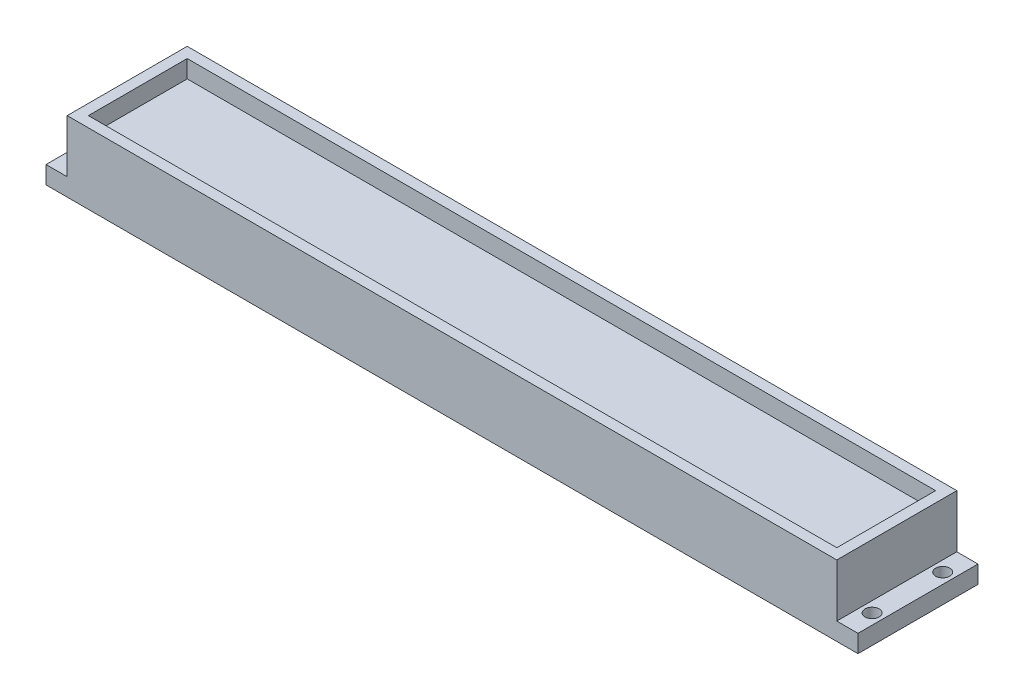
ISO-10303-21;
HEADER;
FILE_DESCRIPTION(('STEP AP214'),'2;1');
FILE_NAME('part.step','',(''),(''),'','','');
FILE_SCHEMA(('AUTOMOTIVE_DESIGN { 1 0 10303 214 1 1 1 1 }'));
ENDSEC;
DATA;
#1=APPLICATION_CONTEXT('core data for automotive mechanical design processes');
#2=APPLICATION_PROTOCOL_DEFINITION('international standard','automotive_design',2000,#1);
#3=PRODUCT_CONTEXT('',#1,'mechanical');
#4=PRODUCT('Part','Part','',(#3));
#5=PRODUCT_RELATED_PRODUCT_CATEGORY('part','',(#4));
#6=PRODUCT_DEFINITION_FORMATION('','',#4);
#7=PRODUCT_DEFINITION_CONTEXT('part definition',#1,'design');
#8=PRODUCT_DEFINITION('design','',#6,#7);
#9=PRODUCT_DEFINITION_SHAPE('','',#8);
#10=(LENGTH_UNIT() NAMED_UNIT(*) SI_UNIT(.MILLI.,.METRE.));
#11=(NAMED_UNIT(*) PLANE_ANGLE_UNIT() SI_UNIT($,.RADIAN.));
#12=(NAMED_UNIT(*) SI_UNIT($,.STERADIAN.) SOLID_ANGLE_UNIT());
#13=UNCERTAINTY_MEASURE_WITH_UNIT(LENGTH_MEASURE(1.E-05),#10,'distance_accuracy_value','');
#14=(GEOMETRIC_REPRESENTATION_CONTEXT(3) GLOBAL_UNCERTAINTY_ASSIGNED_CONTEXT((#13)) GLOBAL_UNIT_ASSIGNED_CONTEXT((#10,
#11,#12)) REPRESENTATION_CONTEXT('',''));
#15=CARTESIAN_POINT('',(0.,0.,0.));
#16=DIRECTION('',(0.,0.,1.));
#17=DIRECTION('',(1.,0.,0.));
#18=AXIS2_PLACEMENT_3D('',#15,#16,#17);
#19=CARTESIAN_POINT('',(0.,0.,34.));
#20=DIRECTION('',(1.,0.,0.));
#21=DIRECTION('',(0.,0.,-1.));
#22=AXIS2_PLACEMENT_3D('',#19,#20,#21);
#23=PLANE('',#22);
#24=DIRECTION('',(0.,-1.,0.));
#25=VECTOR('',#24,1.);
#26=CARTESIAN_POINT('',(0.,0.,0.));
#27=LINE('',#26,#25);
#28=CARTESIAN_POINT('',(0.,5.,0.));
#29=VERTEX_POINT('',#28);
#30=CARTESIAN_POINT('',(0.,0.,0.));
#31=VERTEX_POINT('',#30);
#32=EDGE_CURVE('E173',#29,#31,#27,.T.);
#33=ORIENTED_EDGE('',*,*,#32,.T.);
#34=DIRECTION('',(0.,0.,-1.));
#35=VECTOR('',#34,1.);
#36=CARTESIAN_POINT('',(0.,0.,34.));
#37=LINE('',#36,#35);
#38=CARTESIAN_POINT('',(0.,0.,34.));
#39=VERTEX_POINT('',#38);
#40=EDGE_CURVE('E11',#39,#31,#37,.T.);
#41=ORIENTED_EDGE('',*,*,#40,.F.);
#42=DIRECTION('',(0.,-1.,0.));
#43=VECTOR('',#42,1.);
#44=CARTESIAN_POINT('',(0.,0.,34.));
#45=LINE('',#44,#43);
#46=CARTESIAN_POINT('',(0.,5.,34.));
#47=VERTEX_POINT('',#46);
#48=EDGE_CURVE('E185',#47,#39,#45,.T.);
#49=ORIENTED_EDGE('',*,*,#48,.F.);
#50=DIRECTION('',(0.,0.,-1.));
#51=VECTOR('',#50,1.);
#52=CARTESIAN_POINT('',(0.,5.,34.));
#53=LINE('',#52,#51);
#54=EDGE_CURVE('E186',#47,#29,#53,.T.);
#55=ORIENTED_EDGE('',*,*,#54,.T.);
#56=EDGE_LOOP('',(#33,#41,#49,#55));
#57=FACE_BOUND('',#56,.T.);
#58=ADVANCED_FACE('F34',(#57),#23,.F.);
#59=CARTESIAN_POINT('',(0.,0.,34.));
#60=DIRECTION('',(0.,1.,0.));
#61=DIRECTION('',(0.,0.,1.));
#62=AXIS2_PLACEMENT_3D('',#59,#60,#61);
#63=PLANE('',#62);
#64=CARTESIAN_POINT('',(227.,0.,7.));
#65=DIRECTION('',(0.,1.,0.));
#66=DIRECTION('',(0.,0.,1.));
#67=AXIS2_PLACEMENT_3D('',#64,#65,#66);
#68=CIRCLE('',#67,2.);
#69=CARTESIAN_POINT('',(227.,0.,9.));
#70=VERTEX_POINT('',#69);
#71=EDGE_CURVE('E400',#70,#70,#68,.F.);
#72=ORIENTED_EDGE('',*,*,#71,.F.);
#73=EDGE_LOOP('',(#72));
#74=FACE_BOUND('',#73,.T.);
#75=CARTESIAN_POINT('',(227.,0.,27.));
#76=DIRECTION('',(0.,1.,0.));
#77=DIRECTION('',(0.,0.,1.));
#78=AXIS2_PLACEMENT_3D('',#75,#76,#77);
#79=CIRCLE('',#78,2.);
#80=CARTESIAN_POINT('',(227.,0.,29.));
#81=VERTEX_POINT('',#80);
#82=EDGE_CURVE('E404',#81,#81,#79,.F.);
#83=ORIENTED_EDGE('',*,*,#82,.F.);
#84=EDGE_LOOP('',(#83));
#85=FACE_BOUND('',#84,.T.);
#86=CARTESIAN_POINT('',(3.,0.,27.));
#87=DIRECTION('',(0.,1.,0.));
#88=DIRECTION('',(0.,0.,1.));
#89=AXIS2_PLACEMENT_3D('',#86,#87,#88);
#90=CIRCLE('',#89,2.);
#91=CARTESIAN_POINT('',(3.,0.,29.));
#92=VERTEX_POINT('',#91);
#93=EDGE_CURVE('E413',#92,#92,#90,.F.);
#94=ORIENTED_EDGE('',*,*,#93,.F.);
#95=EDGE_LOOP('',(#94));
#96=FACE_BOUND('',#95,.T.);
#97=CARTESIAN_POINT('',(3.,0.,7.));
#98=DIRECTION('',(0.,1.,0.));
#99=DIRECTION('',(0.,0.,1.));
#100=AXIS2_PLACEMENT_3D('',#97,#98,#99);
#101=CIRCLE('',#100,2.);
#102=CARTESIAN_POINT('',(3.,0.,9.));
#103=VERTEX_POINT('',#102);
#104=EDGE_CURVE('E134',#103,#103,#101,.F.);
#105=ORIENTED_EDGE('',*,*,#104,.F.);
#106=EDGE_LOOP('',(#105));
#107=FACE_BOUND('',#106,.T.);
#108=DIRECTION('',(1.,0.,0.));
#109=VECTOR('',#108,1.);
#110=CARTESIAN_POINT('',(0.,0.,0.));
#111=LINE('',#110,#109);
#112=CARTESIAN_POINT('',(230.,0.,0.));
#113=VERTEX_POINT('',#112);
#114=EDGE_CURVE('E167',#31,#113,#111,.T.);
#115=ORIENTED_EDGE('',*,*,#114,.T.);
#116=DIRECTION('',(0.,0.,-1.));
#117=VECTOR('',#116,1.);
#118=CARTESIAN_POINT('',(230.,0.,34.));
#119=LINE('',#118,#117);
#120=CARTESIAN_POINT('',(230.,0.,34.));
#121=VERTEX_POINT('',#120);
#122=EDGE_CURVE('E41',#121,#113,#119,.T.);
#123=ORIENTED_EDGE('',*,*,#122,.F.);
#124=DIRECTION('',(1.,0.,0.));
#125=VECTOR('',#124,1.);
#126=CARTESIAN_POINT('',(0.,0.,34.));
#127=LINE('',#126,#125);
#128=EDGE_CURVE('E219',#39,#121,#127,.T.);
#129=ORIENTED_EDGE('',*,*,#128,.F.);
#130=ORIENTED_EDGE('',*,*,#40,.T.);
#131=EDGE_LOOP('',(#115,#123,#129,#130));
#132=FACE_BOUND('',#131,.T.);
#133=ADVANCED_FACE('F242',(#74,#85,#96,#107,#132),#63,.F.);
#134=CARTESIAN_POINT('',(230.,0.,34.));
#135=DIRECTION('',(-1.,0.,0.));
#136=DIRECTION('',(0.,0.,1.));
#137=AXIS2_PLACEMENT_3D('',#134,#135,#136);
#138=PLANE('',#137);
#139=DIRECTION('',(0.,1.,0.));
#140=VECTOR('',#139,1.);
#141=CARTESIAN_POINT('',(230.,0.,0.));
#142=LINE('',#141,#140);
#143=CARTESIAN_POINT('',(230.,5.,0.));
#144=VERTEX_POINT('',#143);
#145=EDGE_CURVE('E160',#113,#144,#142,.T.);
#146=ORIENTED_EDGE('',*,*,#145,.T.);
#147=DIRECTION('',(0.,0.,-1.));
#148=VECTOR('',#147,1.);
#149=CARTESIAN_POINT('',(230.,5.,34.));
#150=LINE('',#149,#148);
#151=CARTESIAN_POINT('',(230.,5.,34.));
#152=VERTEX_POINT('',#151);
#153=EDGE_CURVE('E151',#152,#144,#150,.T.);
#154=ORIENTED_EDGE('',*,*,#153,.F.);
#155=DIRECTION('',(0.,1.,0.));
#156=VECTOR('',#155,1.);
#157=CARTESIAN_POINT('',(230.,0.,34.));
#158=LINE('',#157,#156);
#159=EDGE_CURVE('E161',#121,#152,#158,.T.);
#160=ORIENTED_EDGE('',*,*,#159,.F.);
#161=ORIENTED_EDGE('',*,*,#122,.T.);
#162=EDGE_LOOP('',(#146,#154,#160,#161));
#163=FACE_BOUND('',#162,.T.);
#164=ADVANCED_FACE('F158',(#163),#138,.F.);
#165=CARTESIAN_POINT('',(230.,5.,34.));
#166=DIRECTION('',(0.,-1.,0.));
#167=DIRECTION('',(1.,0.,0.));
#168=AXIS2_PLACEMENT_3D('',#165,#166,#167);
#169=PLANE('',#168);
#170=CARTESIAN_POINT('',(227.,5.,7.));
#171=DIRECTION('',(0.,1.,0.));
#172=DIRECTION('',(0.,0.,-1.));
#173=AXIS2_PLACEMENT_3D('',#170,#171,#172);
#174=CIRCLE('',#173,2.);
#175=CARTESIAN_POINT('',(227.,5.,5.));
#176=VERTEX_POINT('',#175);
#177=EDGE_CURVE('E398',#176,#176,#174,.T.);
#178=ORIENTED_EDGE('',*,*,#177,.F.);
#179=EDGE_LOOP('',(#178));
#180=FACE_BOUND('',#179,.T.);
#181=CARTESIAN_POINT('',(227.,5.,27.));
#182=DIRECTION('',(0.,1.,0.));
#183=DIRECTION('',(0.,0.,-1.));
#184=AXIS2_PLACEMENT_3D('',#181,#182,#183);
#185=CIRCLE('',#184,2.);
#186=CARTESIAN_POINT('',(227.,5.,25.));
#187=VERTEX_POINT('',#186);
#188=EDGE_CURVE('E401',#187,#187,#185,.T.);
#189=ORIENTED_EDGE('',*,*,#188,.F.);
#190=EDGE_LOOP('',(#189));
#191=FACE_BOUND('',#190,.T.);
#192=DIRECTION('',(-1.,0.,0.));
#193=VECTOR('',#192,1.);
#194=CARTESIAN_POINT('',(230.,5.,0.));
#195=LINE('',#194,#193);
#196=CARTESIAN_POINT('',(224.,5.,0.));
#197=VERTEX_POINT('',#196);
#198=EDGE_CURVE('E169',#144,#197,#195,.T.);
#199=ORIENTED_EDGE('',*,*,#198,.T.);
#200=DIRECTION('',(0.,0.,-1.));
#201=VECTOR('',#200,1.);
#202=CARTESIAN_POINT('',(224.,5.,34.));
#203=LINE('',#202,#201);
#204=CARTESIAN_POINT('',(224.,5.,34.));
#205=VERTEX_POINT('',#204);
#206=EDGE_CURVE('E148',#205,#197,#203,.T.);
#207=ORIENTED_EDGE('',*,*,#206,.F.);
#208=DIRECTION('',(-1.,0.,0.));
#209=VECTOR('',#208,1.);
#210=CARTESIAN_POINT('',(230.,5.,34.));
#211=LINE('',#210,#209);
#212=EDGE_CURVE('E222',#152,#205,#211,.T.);
#213=ORIENTED_EDGE('',*,*,#212,.F.);
#214=ORIENTED_EDGE('',*,*,#153,.T.);
#215=EDGE_LOOP('',(#199,#207,#213,#214));
#216=FACE_BOUND('',#215,.T.);
#217=ADVANCED_FACE('F246',(#180,#191,#216),#169,.F.);
#218=CARTESIAN_POINT('',(224.,20.,34.));
#219=DIRECTION('',(-1.,0.,0.));
#220=DIRECTION('',(0.,0.,1.));
#221=AXIS2_PLACEMENT_3D('',#218,#219,#220);
#222=PLANE('',#221);
#223=DIRECTION('',(0.,1.,0.));
#224=VECTOR('',#223,1.);
#225=CARTESIAN_POINT('',(224.,20.,0.));
#226=LINE('',#225,#224);
#227=CARTESIAN_POINT('',(224.,20.,0.));
#228=VERTEX_POINT('',#227);
#229=EDGE_CURVE('E171',#197,#228,#226,.T.);
#230=ORIENTED_EDGE('',*,*,#229,.T.);
#231=DIRECTION('',(0.,0.,-1.));
#232=VECTOR('',#231,1.);
#233=CARTESIAN_POINT('',(224.,20.,34.));
#234=LINE('',#233,#232);
#235=CARTESIAN_POINT('',(224.,20.,34.));
#236=VERTEX_POINT('',#235);
#237=EDGE_CURVE('E140',#236,#228,#234,.T.);
#238=ORIENTED_EDGE('',*,*,#237,.F.);
#239=DIRECTION('',(0.,1.,0.));
#240=VECTOR('',#239,1.);
#241=CARTESIAN_POINT('',(224.,20.,34.));
#242=LINE('',#241,#240);
#243=EDGE_CURVE('E224',#205,#236,#242,.T.);
#244=ORIENTED_EDGE('',*,*,#243,.F.);
#245=ORIENTED_EDGE('',*,*,#206,.T.);
#246=EDGE_LOOP('',(#230,#238,#244,#245));
#247=FACE_BOUND('',#246,.T.);
#248=ADVANCED_FACE('F250',(#247),#222,.F.);
#249=CARTESIAN_POINT('',(221.,20.,34.));
#250=DIRECTION('',(1.,0.,0.));
#251=DIRECTION('',(0.,0.,-1.));
#252=AXIS2_PLACEMENT_3D('',#249,#250,#251);
#253=PLANE('',#252);
#254=DIRECTION('',(0.,0.,-1.));
#255=VECTOR('',#254,1.);
#256=CARTESIAN_POINT('',(221.,15.,34.));
#257=LINE('',#256,#255);
#258=CARTESIAN_POINT('',(221.,14.9999999999864,31.));
#259=VERTEX_POINT('',#258);
#260=CARTESIAN_POINT('',(221.,15.,3.));
#261=VERTEX_POINT('',#260);
#262=EDGE_CURVE('E56',#259,#261,#257,.T.);
#263=ORIENTED_EDGE('',*,*,#262,.F.);
#264=DIRECTION('',(0.,1.,0.));
#265=VECTOR('',#264,1.);
#266=CARTESIAN_POINT('',(221.,-500000.,31.));
#267=LINE('',#266,#265);
#268=CARTESIAN_POINT('',(221.,20.,31.));
#269=VERTEX_POINT('',#268);
#270=EDGE_CURVE('E123',#259,#269,#267,.T.);
#271=ORIENTED_EDGE('',*,*,#270,.T.);
#272=DIRECTION('',(0.,0.,-1.));
#273=VECTOR('',#272,1.);
#274=CARTESIAN_POINT('',(221.,20.,34.));
#275=LINE('',#274,#273);
#276=CARTESIAN_POINT('',(221.,20.,3.));
#277=VERTEX_POINT('',#276);
#278=EDGE_CURVE('E48',#269,#277,#275,.T.);
#279=ORIENTED_EDGE('',*,*,#278,.T.);
#280=DIRECTION('',(0.,1.,0.));
#281=VECTOR('',#280,1.);
#282=CARTESIAN_POINT('',(221.,-500000.,3.));
#283=LINE('',#282,#281);
#284=EDGE_CURVE('E137',#261,#277,#283,.T.);
#285=ORIENTED_EDGE('',*,*,#284,.F.);
#286=EDGE_LOOP('',(#263,#271,#279,#285));
#287=FACE_BOUND('',#286,.T.);
#288=ADVANCED_FACE('F136',(#287),#253,.F.);
#289=CARTESIAN_POINT('',(221.,15.,34.));
#290=DIRECTION('',(0.,-1.,0.));
#291=DIRECTION('',(0.,0.,-1.));
#292=AXIS2_PLACEMENT_3D('',#289,#290,#291);
#293=PLANE('',#292);
#294=DIRECTION('',(0.,0.,-1.));
#295=VECTOR('',#294,1.);
#296=CARTESIAN_POINT('',(9.,15.,34.));
#297=LINE('',#296,#295);
#298=CARTESIAN_POINT('',(9.,14.9999999999864,31.));
#299=VERTEX_POINT('',#298);
#300=CARTESIAN_POINT('',(9.,15.,3.));
#301=VERTEX_POINT('',#300);
#302=EDGE_CURVE('E133',#299,#301,#297,.T.);
#303=ORIENTED_EDGE('',*,*,#302,.F.);
#304=DIRECTION('',(-1.,0.,0.));
#305=VECTOR('',#304,1.);
#306=CARTESIAN_POINT('',(9.,14.9999999999864,31.));
#307=LINE('',#306,#305);
#308=EDGE_CURVE('E125',#259,#299,#307,.T.);
#309=ORIENTED_EDGE('',*,*,#308,.F.);
#310=ORIENTED_EDGE('',*,*,#262,.T.);
#311=DIRECTION('',(1.,0.,0.));
#312=VECTOR('',#311,1.);
#313=CARTESIAN_POINT('',(221.,14.9999999999864,3.));
#314=LINE('',#313,#312);
#315=EDGE_CURVE('E208',#301,#261,#314,.T.);
#316=ORIENTED_EDGE('',*,*,#315,.F.);
#317=EDGE_LOOP('',(#303,#309,#310,#316));
#318=FACE_BOUND('',#317,.T.);
#319=ADVANCED_FACE('F132',(#318),#293,.F.);
#320=CARTESIAN_POINT('',(9.,20.,34.));
#321=DIRECTION('',(-1.,0.,0.));
#322=DIRECTION('',(0.,0.,1.));
#323=AXIS2_PLACEMENT_3D('',#320,#321,#322);
#324=PLANE('',#323);
#325=DIRECTION('',(0.,0.,-1.));
#326=VECTOR('',#325,1.);
#327=CARTESIAN_POINT('',(9.,20.,34.));
#328=LINE('',#327,#326);
#329=CARTESIAN_POINT('',(9.,20.,31.));
#330=VERTEX_POINT('',#329);
#331=CARTESIAN_POINT('',(9.,20.,3.));
#332=VERTEX_POINT('',#331);
#333=EDGE_CURVE('E142',#330,#332,#328,.T.);
#334=ORIENTED_EDGE('',*,*,#333,.F.);
#335=DIRECTION('',(0.,1.,0.));
#336=VECTOR('',#335,1.);
#337=CARTESIAN_POINT('',(9.,-500000.,31.));
#338=LINE('',#337,#336);
#339=EDGE_CURVE('E129',#299,#330,#338,.T.);
#340=ORIENTED_EDGE('',*,*,#339,.F.);
#341=ORIENTED_EDGE('',*,*,#302,.T.);
#342=DIRECTION('',(0.,1.,0.));
#343=VECTOR('',#342,1.);
#344=CARTESIAN_POINT('',(9.00000000000001,-500000.,3.));
#345=LINE('',#344,#343);
#346=EDGE_CURVE('E205',#301,#332,#345,.T.);
#347=ORIENTED_EDGE('',*,*,#346,.T.);
#348=EDGE_LOOP('',(#334,#340,#341,#347));
#349=FACE_BOUND('',#348,.T.);
#350=ADVANCED_FACE('F206',(#349),#324,.F.);
#351=CARTESIAN_POINT('',(6.,20.,34.));
#352=DIRECTION('',(0.,-1.,0.));
#353=DIRECTION('',(0.,0.,-1.));
#354=AXIS2_PLACEMENT_3D('',#351,#352,#353);
#355=PLANE('',#354);
#356=ORIENTED_EDGE('',*,*,#278,.F.);
#357=DIRECTION('',(-1.,0.,0.));
#358=VECTOR('',#357,1.);
#359=CARTESIAN_POINT('',(9.,20.,31.));
#360=LINE('',#359,#358);
#361=EDGE_CURVE('E128',#269,#330,#360,.T.);
#362=ORIENTED_EDGE('',*,*,#361,.T.);
#363=ORIENTED_EDGE('',*,*,#333,.T.);
#364=DIRECTION('',(1.,0.,0.));
#365=VECTOR('',#364,1.);
#366=CARTESIAN_POINT('',(221.,20.,3.));
#367=LINE('',#366,#365);
#368=EDGE_CURVE('E202',#332,#277,#367,.T.);
#369=ORIENTED_EDGE('',*,*,#368,.T.);
#370=EDGE_LOOP('',(#356,#362,#363,#369));
#371=FACE_BOUND('',#370,.T.);
#372=DIRECTION('',(-1.,0.,0.));
#373=VECTOR('',#372,1.);
#374=CARTESIAN_POINT('',(6.,20.,0.));
#375=LINE('',#374,#373);
#376=CARTESIAN_POINT('',(6.,20.,0.));
#377=VERTEX_POINT('',#376);
#378=EDGE_CURVE('E179',#228,#377,#375,.T.);
#379=ORIENTED_EDGE('',*,*,#378,.T.);
#380=DIRECTION('',(0.,0.,-1.));
#381=VECTOR('',#380,1.);
#382=CARTESIAN_POINT('',(6.,20.,34.));
#383=LINE('',#382,#381);
#384=CARTESIAN_POINT('',(6.,20.,34.));
#385=VERTEX_POINT('',#384);
#386=EDGE_CURVE('E193',#385,#377,#383,.T.);
#387=ORIENTED_EDGE('',*,*,#386,.F.);
#388=DIRECTION('',(-1.,0.,0.));
#389=VECTOR('',#388,1.);
#390=CARTESIAN_POINT('',(224.,20.,34.));
#391=LINE('',#390,#389);
#392=EDGE_CURVE('E226',#236,#385,#391,.T.);
#393=ORIENTED_EDGE('',*,*,#392,.F.);
#394=ORIENTED_EDGE('',*,*,#237,.T.);
#395=EDGE_LOOP('',(#379,#387,#393,#394));
#396=FACE_BOUND('',#395,.T.);
#397=ADVANCED_FACE('F199',(#371,#396),#355,.F.);
#398=CARTESIAN_POINT('',(6.,5.,34.));
#399=DIRECTION('',(1.,0.,0.));
#400=DIRECTION('',(0.,0.,-1.));
#401=AXIS2_PLACEMENT_3D('',#398,#399,#400);
#402=PLANE('',#401);
#403=DIRECTION('',(0.,-1.,0.));
#404=VECTOR('',#403,1.);
#405=CARTESIAN_POINT('',(6.,5.,0.));
#406=LINE('',#405,#404);
#407=CARTESIAN_POINT('',(6.,5.,0.));
#408=VERTEX_POINT('',#407);
#409=EDGE_CURVE('E181',#377,#408,#406,.T.);
#410=ORIENTED_EDGE('',*,*,#409,.T.);
#411=DIRECTION('',(0.,0.,-1.));
#412=VECTOR('',#411,1.);
#413=CARTESIAN_POINT('',(6.,5.,34.));
#414=LINE('',#413,#412);
#415=CARTESIAN_POINT('',(6.,5.,34.));
#416=VERTEX_POINT('',#415);
#417=EDGE_CURVE('E189',#416,#408,#414,.T.);
#418=ORIENTED_EDGE('',*,*,#417,.F.);
#419=DIRECTION('',(0.,-1.,0.));
#420=VECTOR('',#419,1.);
#421=CARTESIAN_POINT('',(6.,5.,34.));
#422=LINE('',#421,#420);
#423=EDGE_CURVE('E228',#385,#416,#422,.T.);
#424=ORIENTED_EDGE('',*,*,#423,.F.);
#425=ORIENTED_EDGE('',*,*,#386,.T.);
#426=EDGE_LOOP('',(#410,#418,#424,#425));
#427=FACE_BOUND('',#426,.T.);
#428=ADVANCED_FACE('F255',(#427),#402,.F.);
#429=CARTESIAN_POINT('',(0.,5.,34.));
#430=DIRECTION('',(0.,-1.,0.));
#431=DIRECTION('',(0.,0.,-1.));
#432=AXIS2_PLACEMENT_3D('',#429,#430,#431);
#433=PLANE('',#432);
#434=CARTESIAN_POINT('',(3.,5.,27.));
#435=DIRECTION('',(0.,1.,0.));
#436=DIRECTION('',(0.,0.,1.));
#437=AXIS2_PLACEMENT_3D('',#434,#435,#436);
#438=CIRCLE('',#437,2.);
#439=CARTESIAN_POINT('',(3.,5.,29.));
#440=VERTEX_POINT('',#439);
#441=EDGE_CURVE('E410',#440,#440,#438,.T.);
#442=ORIENTED_EDGE('',*,*,#441,.F.);
#443=EDGE_LOOP('',(#442));
#444=FACE_BOUND('',#443,.T.);
#445=CARTESIAN_POINT('',(3.,5.,7.));
#446=DIRECTION('',(0.,1.,0.));
#447=DIRECTION('',(0.,0.,1.));
#448=AXIS2_PLACEMENT_3D('',#445,#446,#447);
#449=CIRCLE('',#448,2.);
#450=CARTESIAN_POINT('',(3.,5.,9.));
#451=VERTEX_POINT('',#450);
#452=EDGE_CURVE('E416',#451,#451,#449,.T.);
#453=ORIENTED_EDGE('',*,*,#452,.F.);
#454=EDGE_LOOP('',(#453));
#455=FACE_BOUND('',#454,.T.);
#456=DIRECTION('',(-1.,0.,0.));
#457=VECTOR('',#456,1.);
#458=CARTESIAN_POINT('',(0.,5.,0.));
#459=LINE('',#458,#457);
#460=EDGE_CURVE('E183',#408,#29,#459,.T.);
#461=ORIENTED_EDGE('',*,*,#460,.T.);
#462=ORIENTED_EDGE('',*,*,#54,.F.);
#463=DIRECTION('',(-1.,0.,0.));
#464=VECTOR('',#463,1.);
#465=CARTESIAN_POINT('',(0.,5.,34.));
#466=LINE('',#465,#464);
#467=EDGE_CURVE('E190',#416,#47,#466,.T.);
#468=ORIENTED_EDGE('',*,*,#467,.F.);
#469=ORIENTED_EDGE('',*,*,#417,.T.);
#470=EDGE_LOOP('',(#461,#462,#468,#469));
#471=FACE_BOUND('',#470,.T.);
#472=ADVANCED_FACE('F239',(#444,#455,#471),#433,.F.);
#473=CARTESIAN_POINT('',(0.,5.,34.));
#474=DIRECTION('',(0.,0.,-1.));
#475=DIRECTION('',(-1.,0.,0.));
#476=AXIS2_PLACEMENT_3D('',#473,#474,#475);
#477=PLANE('',#476);
#478=ORIENTED_EDGE('',*,*,#48,.T.);
#479=ORIENTED_EDGE('',*,*,#128,.T.);
#480=ORIENTED_EDGE('',*,*,#159,.T.);
#481=ORIENTED_EDGE('',*,*,#212,.T.);
#482=ORIENTED_EDGE('',*,*,#243,.T.);
#483=ORIENTED_EDGE('',*,*,#392,.T.);
#484=ORIENTED_EDGE('',*,*,#423,.T.);
#485=ORIENTED_EDGE('',*,*,#467,.T.);
#486=EDGE_LOOP('',(#478,#479,#480,#481,#482,#483,#484,#485));
#487=FACE_BOUND('',#486,.T.);
#488=ADVANCED_FACE('F233',(#487),#477,.F.);
#489=CARTESIAN_POINT('',(0.,5.,0.));
#490=DIRECTION('',(0.,0.,-1.));
#491=DIRECTION('',(-1.,0.,0.));
#492=AXIS2_PLACEMENT_3D('',#489,#490,#491);
#493=PLANE('',#492);
#494=ORIENTED_EDGE('',*,*,#378,.F.);
#495=ORIENTED_EDGE('',*,*,#229,.F.);
#496=ORIENTED_EDGE('',*,*,#198,.F.);
#497=ORIENTED_EDGE('',*,*,#145,.F.);
#498=ORIENTED_EDGE('',*,*,#114,.F.);
#499=ORIENTED_EDGE('',*,*,#32,.F.);
#500=ORIENTED_EDGE('',*,*,#460,.F.);
#501=ORIENTED_EDGE('',*,*,#409,.F.);
#502=EDGE_LOOP('',(#494,#495,#496,#497,#498,#499,#500,#501));
#503=FACE_BOUND('',#502,.T.);
#504=ADVANCED_FACE('F165',(#503),#493,.T.);
#505=CARTESIAN_POINT('',(221.,-500000.,3.));
#506=DIRECTION('',(0.,0.,1.));
#507=DIRECTION('',(1.,0.,0.));
#508=AXIS2_PLACEMENT_3D('',#505,#506,#507);
#509=PLANE('',#508);
#510=ORIENTED_EDGE('',*,*,#346,.F.);
#511=ORIENTED_EDGE('',*,*,#315,.T.);
#512=ORIENTED_EDGE('',*,*,#284,.T.);
#513=ORIENTED_EDGE('',*,*,#368,.F.);
#514=EDGE_LOOP('',(#510,#511,#512,#513));
#515=FACE_BOUND('',#514,.T.);
#516=ADVANCED_FACE('F210',(#515),#509,.T.);
#517=CARTESIAN_POINT('',(9.,-500000.,31.));
#518=DIRECTION('',(0.,0.,-1.));
#519=DIRECTION('',(-1.,0.,0.));
#520=AXIS2_PLACEMENT_3D('',#517,#518,#519);
#521=PLANE('',#520);
#522=ORIENTED_EDGE('',*,*,#270,.F.);
#523=ORIENTED_EDGE('',*,*,#308,.T.);
#524=ORIENTED_EDGE('',*,*,#339,.T.);
#525=ORIENTED_EDGE('',*,*,#361,.F.);
#526=EDGE_LOOP('',(#522,#523,#524,#525));
#527=FACE_BOUND('',#526,.T.);
#528=ADVANCED_FACE('F124',(#527),#521,.T.);
#529=CARTESIAN_POINT('',(3.,-0.00100000000000013,7.));
#530=DIRECTION('',(0.,1.,0.));
#531=DIRECTION('',(0.,0.,1.));
#532=AXIS2_PLACEMENT_3D('',#529,#530,#531);
#533=CYLINDRICAL_SURFACE('',#532,2.);
#534=ORIENTED_EDGE('',*,*,#452,.T.);
#535=EDGE_LOOP('',(#534));
#536=FACE_BOUND('',#535,.T.);
#537=ORIENTED_EDGE('',*,*,#104,.T.);
#538=EDGE_LOOP('',(#537));
#539=FACE_BOUND('',#538,.T.);
#540=ADVANCED_FACE('F331',(#536,#539),#533,.F.);
#541=CARTESIAN_POINT('',(3.,-0.00100000000000013,27.));
#542=DIRECTION('',(0.,1.,0.));
#543=DIRECTION('',(0.,0.,1.));
#544=AXIS2_PLACEMENT_3D('',#541,#542,#543);
#545=CYLINDRICAL_SURFACE('',#544,2.);
#546=ORIENTED_EDGE('',*,*,#441,.T.);
#547=EDGE_LOOP('',(#546));
#548=FACE_BOUND('',#547,.T.);
#549=ORIENTED_EDGE('',*,*,#93,.T.);
#550=EDGE_LOOP('',(#549));
#551=FACE_BOUND('',#550,.T.);
#552=ADVANCED_FACE('F361',(#548,#551),#545,.F.);
#553=CARTESIAN_POINT('',(227.,-0.00100000000000013,27.));
#554=DIRECTION('',(0.,1.,0.));
#555=DIRECTION('',(0.,0.,1.));
#556=AXIS2_PLACEMENT_3D('',#553,#554,#555);
#557=CYLINDRICAL_SURFACE('',#556,2.);
#558=ORIENTED_EDGE('',*,*,#188,.T.);
#559=EDGE_LOOP('',(#558));
#560=FACE_BOUND('',#559,.T.);
#561=ORIENTED_EDGE('',*,*,#82,.T.);
#562=EDGE_LOOP('',(#561));
#563=FACE_BOUND('',#562,.T.);
#564=ADVANCED_FACE('F371',(#560,#563),#557,.F.);
#565=CARTESIAN_POINT('',(227.,-0.00100000000000013,7.));
#566=DIRECTION('',(0.,1.,0.));
#567=DIRECTION('',(0.,0.,1.));
#568=AXIS2_PLACEMENT_3D('',#565,#566,#567);
#569=CYLINDRICAL_SURFACE('',#568,2.);
#570=ORIENTED_EDGE('',*,*,#177,.T.);
#571=EDGE_LOOP('',(#570));
#572=FACE_BOUND('',#571,.T.);
#573=ORIENTED_EDGE('',*,*,#71,.T.);
#574=EDGE_LOOP('',(#573));
#575=FACE_BOUND('',#574,.T.);
#576=ADVANCED_FACE('F381',(#572,#575),#569,.F.);
#577=CLOSED_SHELL('',(#58,#133,#164,#217,#248,#288,#319,#350,#397,#428,#472,#488,#504,#516,#528,
#540,#552,#564,#576));
#578=MANIFOLD_SOLID_BREP('B2',#577);
#579=ADVANCED_BREP_SHAPE_REPRESENTATION('',(#18,#578),#14);
#580=SHAPE_DEFINITION_REPRESENTATION(#9,#579);
ENDSEC;
END-ISO-10303-21;
